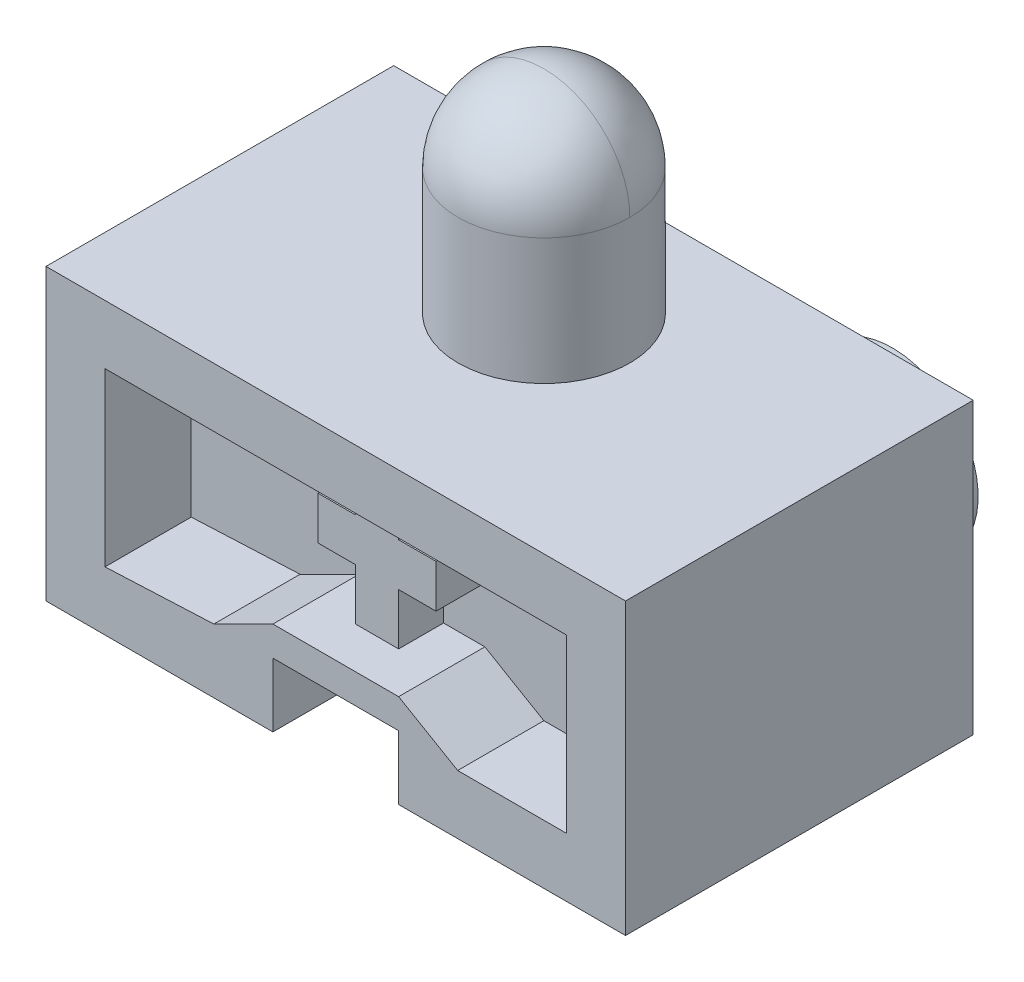
ISO-10303-21;
HEADER;
FILE_DESCRIPTION(('STEP AP214'),'2;1');
FILE_NAME('part.step','',(''),(''),'','','');
FILE_SCHEMA(('AUTOMOTIVE_DESIGN { 1 0 10303 214 1 1 1 1 }'));
ENDSEC;
DATA;
#1=APPLICATION_CONTEXT('core data for automotive mechanical design processes');
#2=APPLICATION_PROTOCOL_DEFINITION('international standard','automotive_design',2000,#1);
#3=PRODUCT_CONTEXT('',#1,'mechanical');
#4=PRODUCT('Part','Part','',(#3));
#5=PRODUCT_RELATED_PRODUCT_CATEGORY('part','',(#4));
#6=PRODUCT_DEFINITION_FORMATION('','',#4);
#7=PRODUCT_DEFINITION_CONTEXT('part definition',#1,'design');
#8=PRODUCT_DEFINITION('design','',#6,#7);
#9=PRODUCT_DEFINITION_SHAPE('','',#8);
#10=(LENGTH_UNIT() NAMED_UNIT(*) SI_UNIT(.MILLI.,.METRE.));
#11=(NAMED_UNIT(*) PLANE_ANGLE_UNIT() SI_UNIT($,.RADIAN.));
#12=(NAMED_UNIT(*) SI_UNIT($,.STERADIAN.) SOLID_ANGLE_UNIT());
#13=UNCERTAINTY_MEASURE_WITH_UNIT(LENGTH_MEASURE(1.E-05),#10,'distance_accuracy_value','');
#14=(GEOMETRIC_REPRESENTATION_CONTEXT(3) GLOBAL_UNCERTAINTY_ASSIGNED_CONTEXT((#13)) GLOBAL_UNIT_ASSIGNED_CONTEXT((#10,
#11,#12)) REPRESENTATION_CONTEXT('',''));
#15=CARTESIAN_POINT('',(0.,0.,0.));
#16=DIRECTION('',(0.,0.,1.));
#17=DIRECTION('',(1.,0.,0.));
#18=AXIS2_PLACEMENT_3D('',#15,#16,#17);
#19=CARTESIAN_POINT('',(-1.524,13.29055,6.19506));
#20=DIRECTION('',(0.,1.,0.));
#21=DIRECTION('',(0.,0.,1.));
#22=AXIS2_PLACEMENT_3D('',#19,#20,#21);
#23=PLANE('',#22);
#24=DIRECTION('',(0.,0.,1.));
#25=VECTOR('',#24,1.);
#26=CARTESIAN_POINT('',(-1.524,13.29055,6.19506));
#27=LINE('',#26,#25);
#28=CARTESIAN_POINT('',(-1.524,13.29055,6.19506));
#29=VERTEX_POINT('',#28);
#30=CARTESIAN_POINT('',(-1.524,13.29055,9.37006));
#31=VERTEX_POINT('',#30);
#32=EDGE_CURVE('E235',#29,#31,#27,.T.);
#33=ORIENTED_EDGE('',*,*,#32,.F.);
#34=DIRECTION('',(1.,0.,0.));
#35=VECTOR('',#34,1.);
#36=CARTESIAN_POINT('',(0.,13.29055,6.19506));
#37=LINE('',#36,#35);
#38=CARTESIAN_POINT('',(-4.17195,13.29055,6.19506));
#39=VERTEX_POINT('',#38);
#40=EDGE_CURVE('E376',#39,#29,#37,.T.);
#41=ORIENTED_EDGE('',*,*,#40,.F.);
#42=DIRECTION('',(0.,0.,1.));
#43=VECTOR('',#42,1.);
#44=CARTESIAN_POINT('',(-4.17195,13.29055,6.19506));
#45=LINE('',#44,#43);
#46=CARTESIAN_POINT('',(-4.17195,13.29055,9.37006));
#47=VERTEX_POINT('',#46);
#48=EDGE_CURVE('E245',#47,#39,#45,.F.);
#49=ORIENTED_EDGE('',*,*,#48,.F.);
#50=DIRECTION('',(1.,0.,0.));
#51=VECTOR('',#50,1.);
#52=CARTESIAN_POINT('',(0.,13.29055,9.37006));
#53=LINE('',#52,#51);
#54=EDGE_CURVE('E349',#31,#47,#53,.F.);
#55=ORIENTED_EDGE('',*,*,#54,.F.);
#56=EDGE_LOOP('',(#33,#41,#49,#55));
#57=FACE_BOUND('',#56,.T.);
#58=ADVANCED_FACE('F16',(#57),#23,.T.);
#59=CARTESIAN_POINT('',(-4.17195,13.29055,6.19506));
#60=DIRECTION('',(-1.,0.,0.));
#61=DIRECTION('',(0.,-1.,0.));
#62=AXIS2_PLACEMENT_3D('',#59,#60,#61);
#63=PLANE('',#62);
#64=ORIENTED_EDGE('',*,*,#48,.T.);
#65=DIRECTION('',(0.,1.,0.));
#66=VECTOR('',#65,1.);
#67=CARTESIAN_POINT('',(-4.17195,0.,6.19506));
#68=LINE('',#67,#66);
#69=CARTESIAN_POINT('',(-4.17195,10.24255,6.19506));
#70=VERTEX_POINT('',#69);
#71=EDGE_CURVE('E228',#70,#39,#68,.T.);
#72=ORIENTED_EDGE('',*,*,#71,.F.);
#73=DIRECTION('',(0.,0.,-1.));
#74=VECTOR('',#73,1.);
#75=CARTESIAN_POINT('',(-4.17195,10.24255,6.19506));
#76=LINE('',#75,#74);
#77=CARTESIAN_POINT('',(-4.17195,10.24255,9.37006));
#78=VERTEX_POINT('',#77);
#79=EDGE_CURVE('E207',#78,#70,#76,.T.);
#80=ORIENTED_EDGE('',*,*,#79,.F.);
#81=DIRECTION('',(0.,1.,0.));
#82=VECTOR('',#81,1.);
#83=CARTESIAN_POINT('',(-4.17195,0.,9.37006));
#84=LINE('',#83,#82);
#85=EDGE_CURVE('E346',#47,#78,#84,.F.);
#86=ORIENTED_EDGE('',*,*,#85,.F.);
#87=EDGE_LOOP('',(#64,#72,#80,#86));
#88=FACE_BOUND('',#87,.T.);
#89=ADVANCED_FACE('F379',(#88),#63,.T.);
#90=CARTESIAN_POINT('',(-4.17195,10.24255,6.19506));
#91=DIRECTION('',(0.,-1.,0.));
#92=DIRECTION('',(0.,0.,-1.));
#93=AXIS2_PLACEMENT_3D('',#90,#91,#92);
#94=PLANE('',#93);
#95=ORIENTED_EDGE('',*,*,#79,.T.);
#96=DIRECTION('',(1.,0.,0.));
#97=VECTOR('',#96,1.);
#98=CARTESIAN_POINT('',(0.,10.24255,6.19506));
#99=LINE('',#98,#97);
#100=CARTESIAN_POINT('',(-1.524,10.24255,6.19506));
#101=VERTEX_POINT('',#100);
#102=EDGE_CURVE('E224',#101,#70,#99,.F.);
#103=ORIENTED_EDGE('',*,*,#102,.F.);
#104=DIRECTION('',(0.,0.,1.));
#105=VECTOR('',#104,1.);
#106=CARTESIAN_POINT('',(-1.524,10.24255,6.19506));
#107=LINE('',#106,#105);
#108=CARTESIAN_POINT('',(-1.524,10.24255,9.37006));
#109=VERTEX_POINT('',#108);
#110=EDGE_CURVE('E212',#109,#101,#107,.F.);
#111=ORIENTED_EDGE('',*,*,#110,.F.);
#112=DIRECTION('',(1.,0.,0.));
#113=VECTOR('',#112,1.);
#114=CARTESIAN_POINT('',(0.,10.24255,9.37006));
#115=LINE('',#114,#113);
#116=EDGE_CURVE('E344',#78,#109,#115,.T.);
#117=ORIENTED_EDGE('',*,*,#116,.F.);
#118=EDGE_LOOP('',(#95,#103,#111,#117));
#119=FACE_BOUND('',#118,.T.);
#120=ADVANCED_FACE('F225',(#119),#94,.T.);
#121=CARTESIAN_POINT('',(1.524,10.24255,6.19506));
#122=DIRECTION('',(0.,-1.,0.));
#123=DIRECTION('',(0.,0.,-1.));
#124=AXIS2_PLACEMENT_3D('',#121,#122,#123);
#125=PLANE('',#124);
#126=DIRECTION('',(0.,0.,-1.));
#127=VECTOR('',#126,1.);
#128=CARTESIAN_POINT('',(1.524,10.24255,6.19506));
#129=LINE('',#128,#127);
#130=CARTESIAN_POINT('',(1.524,10.24255,6.19506));
#131=VERTEX_POINT('',#130);
#132=CARTESIAN_POINT('',(1.524,10.24255,9.37006));
#133=VERTEX_POINT('',#132);
#134=EDGE_CURVE('E220',#131,#133,#129,.F.);
#135=ORIENTED_EDGE('',*,*,#134,.F.);
#136=DIRECTION('',(1.,0.,0.));
#137=VECTOR('',#136,1.);
#138=CARTESIAN_POINT('',(0.,10.24255,6.19506));
#139=LINE('',#138,#137);
#140=CARTESIAN_POINT('',(4.17195,10.24255,6.19506));
#141=VERTEX_POINT('',#140);
#142=EDGE_CURVE('E364',#141,#131,#139,.F.);
#143=ORIENTED_EDGE('',*,*,#142,.F.);
#144=DIRECTION('',(0.,0.,1.));
#145=VECTOR('',#144,1.);
#146=CARTESIAN_POINT('',(4.17195,10.24255,6.19506));
#147=LINE('',#146,#145);
#148=CARTESIAN_POINT('',(4.17195,10.24255,9.37006));
#149=VERTEX_POINT('',#148);
#150=EDGE_CURVE('E242',#149,#141,#147,.F.);
#151=ORIENTED_EDGE('',*,*,#150,.F.);
#152=DIRECTION('',(1.,0.,0.));
#153=VECTOR('',#152,1.);
#154=CARTESIAN_POINT('',(0.,10.24255,9.37006));
#155=LINE('',#154,#153);
#156=EDGE_CURVE('E337',#133,#149,#155,.T.);
#157=ORIENTED_EDGE('',*,*,#156,.F.);
#158=EDGE_LOOP('',(#135,#143,#151,#157));
#159=FACE_BOUND('',#158,.T.);
#160=ADVANCED_FACE('F850',(#159),#125,.T.);
#161=CARTESIAN_POINT('',(4.17195,10.24255,6.19506));
#162=DIRECTION('',(1.,0.,0.));
#163=DIRECTION('',(0.,1.,0.));
#164=AXIS2_PLACEMENT_3D('',#161,#162,#163);
#165=PLANE('',#164);
#166=ORIENTED_EDGE('',*,*,#150,.T.);
#167=DIRECTION('',(0.,1.,0.));
#168=VECTOR('',#167,1.);
#169=CARTESIAN_POINT('',(4.17195,0.,6.19506));
#170=LINE('',#169,#168);
#171=CARTESIAN_POINT('',(4.17195,13.29055,6.19506));
#172=VERTEX_POINT('',#171);
#173=EDGE_CURVE('E367',#172,#141,#170,.F.);
#174=ORIENTED_EDGE('',*,*,#173,.F.);
#175=DIRECTION('',(0.,0.,1.));
#176=VECTOR('',#175,1.);
#177=CARTESIAN_POINT('',(4.17195,13.29055,6.19506));
#178=LINE('',#177,#176);
#179=CARTESIAN_POINT('',(4.17195,13.29055,9.37006));
#180=VERTEX_POINT('',#179);
#181=EDGE_CURVE('E221',#180,#172,#178,.F.);
#182=ORIENTED_EDGE('',*,*,#181,.F.);
#183=DIRECTION('',(0.,1.,0.));
#184=VECTOR('',#183,1.);
#185=CARTESIAN_POINT('',(4.17195,0.,9.37006));
#186=LINE('',#185,#184);
#187=EDGE_CURVE('E334',#149,#180,#186,.T.);
#188=ORIENTED_EDGE('',*,*,#187,.F.);
#189=EDGE_LOOP('',(#166,#174,#182,#188));
#190=FACE_BOUND('',#189,.T.);
#191=ADVANCED_FACE('F839',(#190),#165,.T.);
#192=CARTESIAN_POINT('',(4.17195,13.29055,6.19506));
#193=DIRECTION('',(0.,1.,0.));
#194=DIRECTION('',(0.,0.,1.));
#195=AXIS2_PLACEMENT_3D('',#192,#193,#194);
#196=PLANE('',#195);
#197=ORIENTED_EDGE('',*,*,#181,.T.);
#198=DIRECTION('',(1.,0.,0.));
#199=VECTOR('',#198,1.);
#200=CARTESIAN_POINT('',(0.,13.29055,6.19506));
#201=LINE('',#200,#199);
#202=CARTESIAN_POINT('',(1.524,13.29055,6.19506));
#203=VERTEX_POINT('',#202);
#204=EDGE_CURVE('E370',#203,#172,#201,.T.);
#205=ORIENTED_EDGE('',*,*,#204,.F.);
#206=DIRECTION('',(0.,0.,-1.));
#207=VECTOR('',#206,1.);
#208=CARTESIAN_POINT('',(1.524,13.29055,6.19506));
#209=LINE('',#208,#207);
#210=CARTESIAN_POINT('',(1.524,13.29055,9.37006));
#211=VERTEX_POINT('',#210);
#212=EDGE_CURVE('E358',#211,#203,#209,.T.);
#213=ORIENTED_EDGE('',*,*,#212,.F.);
#214=DIRECTION('',(1.,0.,0.));
#215=VECTOR('',#214,1.);
#216=CARTESIAN_POINT('',(0.,13.29055,9.37006));
#217=LINE('',#216,#215);
#218=EDGE_CURVE('E331',#180,#211,#217,.F.);
#219=ORIENTED_EDGE('',*,*,#218,.F.);
#220=EDGE_LOOP('',(#197,#205,#213,#219));
#221=FACE_BOUND('',#220,.T.);
#222=ADVANCED_FACE('F829',(#221),#196,.T.);
#223=CARTESIAN_POINT('',(-1.524,10.24255,6.19506));
#224=DIRECTION('',(-1.,0.,0.));
#225=DIRECTION('',(0.,0.,1.));
#226=AXIS2_PLACEMENT_3D('',#223,#224,#225);
#227=PLANE('',#226);
#228=ORIENTED_EDGE('',*,*,#110,.T.);
#229=DIRECTION('',(0.,1.,0.));
#230=VECTOR('',#229,1.);
#231=CARTESIAN_POINT('',(-1.524,0.,6.19506));
#232=LINE('',#231,#230);
#233=CARTESIAN_POINT('',(-1.524,6.607175,6.19506));
#234=VERTEX_POINT('',#233);
#235=EDGE_CURVE('E215',#234,#101,#232,.T.);
#236=ORIENTED_EDGE('',*,*,#235,.F.);
#237=DIRECTION('',(0.,0.,-1.));
#238=VECTOR('',#237,1.);
#239=CARTESIAN_POINT('',(-1.524,6.607175,12.29106));
#240=LINE('',#239,#238);
#241=CARTESIAN_POINT('',(-1.524,6.607175,9.37006));
#242=VERTEX_POINT('',#241);
#243=EDGE_CURVE('E316',#234,#242,#240,.F.);
#244=ORIENTED_EDGE('',*,*,#243,.T.);
#245=DIRECTION('',(0.,1.,0.));
#246=VECTOR('',#245,1.);
#247=CARTESIAN_POINT('',(-1.524,0.,9.37006));
#248=LINE('',#247,#246);
#249=EDGE_CURVE('E218',#109,#242,#248,.F.);
#250=ORIENTED_EDGE('',*,*,#249,.F.);
#251=EDGE_LOOP('',(#228,#236,#244,#250));
#252=FACE_BOUND('',#251,.T.);
#253=ADVANCED_FACE('F213',(#252),#227,.T.);
#254=CARTESIAN_POINT('',(1.524,6.607175,6.19506));
#255=DIRECTION('',(1.,0.,0.));
#256=DIRECTION('',(0.,0.,-1.));
#257=AXIS2_PLACEMENT_3D('',#254,#255,#256);
#258=PLANE('',#257);
#259=DIRECTION('',(0.,0.,-1.));
#260=VECTOR('',#259,1.);
#261=CARTESIAN_POINT('',(1.524,6.607175,12.29106));
#262=LINE('',#261,#260);
#263=CARTESIAN_POINT('',(1.524,6.607175,9.37006));
#264=VERTEX_POINT('',#263);
#265=CARTESIAN_POINT('',(1.524,6.607175,6.19506));
#266=VERTEX_POINT('',#265);
#267=EDGE_CURVE('E311',#264,#266,#262,.T.);
#268=ORIENTED_EDGE('',*,*,#267,.T.);
#269=DIRECTION('',(0.,1.,0.));
#270=VECTOR('',#269,1.);
#271=CARTESIAN_POINT('',(1.524,0.,6.19506));
#272=LINE('',#271,#270);
#273=EDGE_CURVE('E361',#131,#266,#272,.F.);
#274=ORIENTED_EDGE('',*,*,#273,.F.);
#275=ORIENTED_EDGE('',*,*,#134,.T.);
#276=DIRECTION('',(0.,1.,0.));
#277=VECTOR('',#276,1.);
#278=CARTESIAN_POINT('',(1.524,0.,9.37006));
#279=LINE('',#278,#277);
#280=EDGE_CURVE('E340',#264,#133,#279,.T.);
#281=ORIENTED_EDGE('',*,*,#280,.F.);
#282=EDGE_LOOP('',(#268,#274,#275,#281));
#283=FACE_BOUND('',#282,.T.);
#284=ADVANCED_FACE('F809',(#283),#258,.T.);
#285=CARTESIAN_POINT('',(-1.524,16.31315,6.19506));
#286=DIRECTION('',(-1.,0.,0.));
#287=DIRECTION('',(0.,0.,1.));
#288=AXIS2_PLACEMENT_3D('',#285,#286,#287);
#289=PLANE('',#288);
#290=DIRECTION('',(0.,0.,1.));
#291=VECTOR('',#290,1.);
#292=CARTESIAN_POINT('',(-1.524,16.31315,12.29106));
#293=LINE('',#292,#291);
#294=CARTESIAN_POINT('',(-1.524,16.31315,9.37006));
#295=VERTEX_POINT('',#294);
#296=CARTESIAN_POINT('',(-1.524,16.31315,6.19506));
#297=VERTEX_POINT('',#296);
#298=EDGE_CURVE('E292',#295,#297,#293,.F.);
#299=ORIENTED_EDGE('',*,*,#298,.T.);
#300=DIRECTION('',(0.,1.,0.));
#301=VECTOR('',#300,1.);
#302=CARTESIAN_POINT('',(-1.524,0.,6.19506));
#303=LINE('',#302,#301);
#304=EDGE_CURVE('E373',#29,#297,#303,.T.);
#305=ORIENTED_EDGE('',*,*,#304,.F.);
#306=ORIENTED_EDGE('',*,*,#32,.T.);
#307=DIRECTION('',(0.,1.,0.));
#308=VECTOR('',#307,1.);
#309=CARTESIAN_POINT('',(-1.524,0.,9.37006));
#310=LINE('',#309,#308);
#311=EDGE_CURVE('E352',#295,#31,#310,.F.);
#312=ORIENTED_EDGE('',*,*,#311,.F.);
#313=EDGE_LOOP('',(#299,#305,#306,#312));
#314=FACE_BOUND('',#313,.T.);
#315=ADVANCED_FACE('F385',(#314),#289,.T.);
#316=CARTESIAN_POINT('',(0.,0.,6.19506));
#317=DIRECTION('',(0.,0.,1.));
#318=DIRECTION('',(1.,0.,0.));
#319=AXIS2_PLACEMENT_3D('',#316,#317,#318);
#320=PLANE('',#319);
#321=ORIENTED_EDGE('',*,*,#40,.T.);
#322=ORIENTED_EDGE('',*,*,#304,.T.);
#323=DIRECTION('',(1.,0.,0.));
#324=VECTOR('',#323,1.);
#325=CARTESIAN_POINT('',(16.31315,16.31315,6.19506));
#326=LINE('',#325,#324);
#327=CARTESIAN_POINT('',(-16.31315,16.31315,6.19506));
#328=VERTEX_POINT('',#327);
#329=EDGE_CURVE('E290',#297,#328,#326,.F.);
#330=ORIENTED_EDGE('',*,*,#329,.T.);
#331=DIRECTION('',(0.,1.,0.));
#332=VECTOR('',#331,1.);
#333=CARTESIAN_POINT('',(-16.31315,16.31315,6.19506));
#334=LINE('',#333,#332);
#335=CARTESIAN_POINT('',(-16.31315,4.17195,6.19506));
#336=VERTEX_POINT('',#335);
#337=EDGE_CURVE('E296',#328,#336,#334,.F.);
#338=ORIENTED_EDGE('',*,*,#337,.T.);
#339=DIRECTION('',(0.998971936315906,0.045332884898824,0.));
#340=VECTOR('',#339,1.);
#341=CARTESIAN_POINT('',(-16.31315,4.17195,6.19506));
#342=LINE('',#341,#340);
#343=CARTESIAN_POINT('',(-8.61695,4.5212,6.19506));
#344=VERTEX_POINT('',#343);
#345=EDGE_CURVE('E300',#336,#344,#342,.T.);
#346=ORIENTED_EDGE('',*,*,#345,.T.);
#347=DIRECTION('',(0.894427190999916,0.447213595499958,0.));
#348=VECTOR('',#347,1.);
#349=CARTESIAN_POINT('',(-8.61695,4.5212,6.19506));
#350=LINE('',#349,#348);
#351=CARTESIAN_POINT('',(-4.445,6.607175,6.19506));
#352=VERTEX_POINT('',#351);
#353=EDGE_CURVE('E304',#344,#352,#350,.T.);
#354=ORIENTED_EDGE('',*,*,#353,.T.);
#355=DIRECTION('',(1.,0.,0.));
#356=VECTOR('',#355,1.);
#357=CARTESIAN_POINT('',(-4.445,6.607175,6.19506));
#358=LINE('',#357,#356);
#359=EDGE_CURVE('E233',#352,#234,#358,.T.);
#360=ORIENTED_EDGE('',*,*,#359,.T.);
#361=ORIENTED_EDGE('',*,*,#235,.T.);
#362=ORIENTED_EDGE('',*,*,#102,.T.);
#363=ORIENTED_EDGE('',*,*,#71,.T.);
#364=EDGE_LOOP('',(#321,#322,#330,#338,#346,#354,#360,#361,#362,#363));
#365=FACE_BOUND('',#364,.T.);
#366=ADVANCED_FACE('F231',(#365),#320,.T.);
#367=CARTESIAN_POINT('',(0.,0.,6.19506));
#368=DIRECTION('',(0.,0.,1.));
#369=DIRECTION('',(1.,0.,0.));
#370=AXIS2_PLACEMENT_3D('',#367,#368,#369);
#371=PLANE('',#370);
#372=ORIENTED_EDGE('',*,*,#142,.T.);
#373=ORIENTED_EDGE('',*,*,#273,.T.);
#374=DIRECTION('',(1.,0.,0.));
#375=VECTOR('',#374,1.);
#376=CARTESIAN_POINT('',(-4.445,6.607175,6.19506));
#377=LINE('',#376,#375);
#378=CARTESIAN_POINT('',(4.445,6.607175,6.19506));
#379=VERTEX_POINT('',#378);
#380=EDGE_CURVE('E309',#266,#379,#377,.T.);
#381=ORIENTED_EDGE('',*,*,#380,.T.);
#382=DIRECTION('',(0.863635836054113,-0.504116199584098,0.));
#383=VECTOR('',#382,1.);
#384=CARTESIAN_POINT('',(4.445,6.607175,6.19506));
#385=LINE('',#384,#383);
#386=CARTESIAN_POINT('',(8.61695,4.17195,6.19506));
#387=VERTEX_POINT('',#386);
#388=EDGE_CURVE('E320',#379,#387,#385,.T.);
#389=ORIENTED_EDGE('',*,*,#388,.T.);
#390=DIRECTION('',(1.,0.,0.));
#391=VECTOR('',#390,1.);
#392=CARTESIAN_POINT('',(8.61695,4.17195,6.19506));
#393=LINE('',#392,#391);
#394=CARTESIAN_POINT('',(16.31315,4.17195,6.19506));
#395=VERTEX_POINT('',#394);
#396=EDGE_CURVE('E324',#387,#395,#393,.T.);
#397=ORIENTED_EDGE('',*,*,#396,.T.);
#398=DIRECTION('',(0.,1.,0.));
#399=VECTOR('',#398,1.);
#400=CARTESIAN_POINT('',(16.31315,4.17195,6.19506));
#401=LINE('',#400,#399);
#402=CARTESIAN_POINT('',(16.31315,16.31315,6.19506));
#403=VERTEX_POINT('',#402);
#404=EDGE_CURVE('E326',#395,#403,#401,.T.);
#405=ORIENTED_EDGE('',*,*,#404,.T.);
#406=DIRECTION('',(1.,0.,0.));
#407=VECTOR('',#406,1.);
#408=CARTESIAN_POINT('',(16.31315,16.31315,6.19506));
#409=LINE('',#408,#407);
#410=CARTESIAN_POINT('',(1.524,16.31315,6.19506));
#411=VERTEX_POINT('',#410);
#412=EDGE_CURVE('E283',#403,#411,#409,.F.);
#413=ORIENTED_EDGE('',*,*,#412,.T.);
#414=DIRECTION('',(0.,1.,0.));
#415=VECTOR('',#414,1.);
#416=CARTESIAN_POINT('',(1.524,13.29055,6.19506));
#417=LINE('',#416,#415);
#418=EDGE_CURVE('E355',#203,#411,#417,.T.);
#419=ORIENTED_EDGE('',*,*,#418,.F.);
#420=ORIENTED_EDGE('',*,*,#204,.T.);
#421=ORIENTED_EDGE('',*,*,#173,.T.);
#422=EDGE_LOOP('',(#372,#373,#381,#389,#397,#405,#413,#419,#420,#421));
#423=FACE_BOUND('',#422,.T.);
#424=ADVANCED_FACE('F432',(#423),#371,.T.);
#425=CARTESIAN_POINT('',(1.524,13.29055,6.19506));
#426=DIRECTION('',(1.,0.,0.));
#427=DIRECTION('',(0.,0.,-1.));
#428=AXIS2_PLACEMENT_3D('',#425,#426,#427);
#429=PLANE('',#428);
#430=ORIENTED_EDGE('',*,*,#212,.T.);
#431=ORIENTED_EDGE('',*,*,#418,.T.);
#432=DIRECTION('',(0.,0.,1.));
#433=VECTOR('',#432,1.);
#434=CARTESIAN_POINT('',(1.524,16.31315,12.29106));
#435=LINE('',#434,#433);
#436=CARTESIAN_POINT('',(1.524,16.31315,9.37006));
#437=VERTEX_POINT('',#436);
#438=EDGE_CURVE('E281',#411,#437,#435,.T.);
#439=ORIENTED_EDGE('',*,*,#438,.T.);
#440=DIRECTION('',(0.,1.,0.));
#441=VECTOR('',#440,1.);
#442=CARTESIAN_POINT('',(1.524,0.,9.37006));
#443=LINE('',#442,#441);
#444=EDGE_CURVE('E328',#211,#437,#443,.T.);
#445=ORIENTED_EDGE('',*,*,#444,.F.);
#446=EDGE_LOOP('',(#430,#431,#439,#445));
#447=FACE_BOUND('',#446,.T.);
#448=ADVANCED_FACE('F429',(#447),#429,.T.);
#449=CARTESIAN_POINT('',(0.,0.,9.37006));
#450=DIRECTION('',(0.,0.,1.));
#451=DIRECTION('',(1.,0.,0.));
#452=AXIS2_PLACEMENT_3D('',#449,#450,#451);
#453=PLANE('',#452);
#454=ORIENTED_EDGE('',*,*,#444,.T.);
#455=DIRECTION('',(1.,0.,0.));
#456=VECTOR('',#455,1.);
#457=CARTESIAN_POINT('',(16.31315,16.31315,9.37006));
#458=LINE('',#457,#456);
#459=EDGE_CURVE('E278',#437,#295,#458,.F.);
#460=ORIENTED_EDGE('',*,*,#459,.T.);
#461=ORIENTED_EDGE('',*,*,#311,.T.);
#462=ORIENTED_EDGE('',*,*,#54,.T.);
#463=ORIENTED_EDGE('',*,*,#85,.T.);
#464=ORIENTED_EDGE('',*,*,#116,.T.);
#465=ORIENTED_EDGE('',*,*,#249,.T.);
#466=DIRECTION('',(1.,0.,0.));
#467=VECTOR('',#466,1.);
#468=CARTESIAN_POINT('',(-4.445,6.607175,9.37006));
#469=LINE('',#468,#467);
#470=EDGE_CURVE('E313',#242,#264,#469,.T.);
#471=ORIENTED_EDGE('',*,*,#470,.T.);
#472=ORIENTED_EDGE('',*,*,#280,.T.);
#473=ORIENTED_EDGE('',*,*,#156,.T.);
#474=ORIENTED_EDGE('',*,*,#187,.T.);
#475=ORIENTED_EDGE('',*,*,#218,.T.);
#476=EDGE_LOOP('',(#454,#460,#461,#462,#463,#464,#465,#471,#472,#473,#474,#475));
#477=FACE_BOUND('',#476,.T.);
#478=ADVANCED_FACE('F425',(#477),#453,.T.);
#479=CARTESIAN_POINT('',(0.,0.,-16.81226));
#480=DIRECTION('',(0.,0.,-1.));
#481=DIRECTION('',(-1.,0.,0.));
#482=AXIS2_PLACEMENT_3D('',#479,#480,#481);
#483=PLANE('',#482);
#484=CARTESIAN_POINT('',(10.24255,10.24255,-16.81226));
#485=DIRECTION('',(0.,0.,-1.));
#486=DIRECTION('',(-1.,0.,0.));
#487=AXIS2_PLACEMENT_3D('',#484,#485,#486);
#488=CIRCLE('',#487,6.0706);
#489=CARTESIAN_POINT('',(4.17195,10.24255,-16.81226));
#490=VERTEX_POINT('',#489);
#491=EDGE_CURVE('E19',#490,#490,#488,.F.);
#492=ORIENTED_EDGE('',*,*,#491,.F.);
#493=EDGE_LOOP('',(#492));
#494=FACE_BOUND('',#493,.T.);
#495=ADVANCED_FACE('F752',(#494),#483,.T.);
#496=CARTESIAN_POINT('',(0.,0.,-16.81226));
#497=DIRECTION('',(0.,0.,-1.));
#498=DIRECTION('',(-1.,0.,0.));
#499=AXIS2_PLACEMENT_3D('',#496,#497,#498);
#500=PLANE('',#499);
#501=CARTESIAN_POINT('',(-10.24255,10.24255,-16.81226));
#502=DIRECTION('',(0.,0.,-1.));
#503=DIRECTION('',(-1.,0.,0.));
#504=AXIS2_PLACEMENT_3D('',#501,#502,#503);
#505=CIRCLE('',#504,6.0706);
#506=CARTESIAN_POINT('',(-16.31315,10.24255,-16.81226));
#507=VERTEX_POINT('',#506);
#508=EDGE_CURVE('E254',#507,#507,#505,.F.);
#509=ORIENTED_EDGE('',*,*,#508,.F.);
#510=EDGE_LOOP('',(#509));
#511=FACE_BOUND('',#510,.T.);
#512=ADVANCED_FACE('F742',(#511),#500,.T.);
#513=CARTESIAN_POINT('',(16.31315,4.17195,12.29106));
#514=DIRECTION('',(1.,0.,0.));
#515=DIRECTION('',(0.,0.,-1.));
#516=AXIS2_PLACEMENT_3D('',#513,#514,#515);
#517=PLANE('',#516);
#518=ORIENTED_EDGE('',*,*,#404,.F.);
#519=DIRECTION('',(0.,0.,-1.));
#520=VECTOR('',#519,1.);
#521=CARTESIAN_POINT('',(16.31315,4.17195,12.29106));
#522=LINE('',#521,#520);
#523=CARTESIAN_POINT('',(16.31315,4.17195,12.29106));
#524=VERTEX_POINT('',#523);
#525=EDGE_CURVE('E322',#395,#524,#522,.F.);
#526=ORIENTED_EDGE('',*,*,#525,.T.);
#527=DIRECTION('',(0.,1.,0.));
#528=VECTOR('',#527,1.);
#529=CARTESIAN_POINT('',(16.31315,0.,12.29106));
#530=LINE('',#529,#528);
#531=CARTESIAN_POINT('',(16.31315,16.31315,12.29106));
#532=VERTEX_POINT('',#531);
#533=EDGE_CURVE('E439',#532,#524,#530,.F.);
#534=ORIENTED_EDGE('',*,*,#533,.F.);
#535=DIRECTION('',(0.,0.,1.));
#536=VECTOR('',#535,1.);
#537=CARTESIAN_POINT('',(16.31315,16.31315,12.29106));
#538=LINE('',#537,#536);
#539=EDGE_CURVE('E285',#532,#403,#538,.F.);
#540=ORIENTED_EDGE('',*,*,#539,.T.);
#541=EDGE_LOOP('',(#518,#526,#534,#540));
#542=FACE_BOUND('',#541,.T.);
#543=ADVANCED_FACE('F437',(#542),#517,.F.);
#544=CARTESIAN_POINT('',(8.61695,4.17195,12.29106));
#545=DIRECTION('',(0.,-1.,0.));
#546=DIRECTION('',(0.,0.,-1.));
#547=AXIS2_PLACEMENT_3D('',#544,#545,#546);
#548=PLANE('',#547);
#549=ORIENTED_EDGE('',*,*,#396,.F.);
#550=DIRECTION('',(0.,0.,1.));
#551=VECTOR('',#550,1.);
#552=CARTESIAN_POINT('',(8.61695,4.17195,12.29106));
#553=LINE('',#552,#551);
#554=CARTESIAN_POINT('',(8.61695,4.17195,12.29106));
#555=VERTEX_POINT('',#554);
#556=EDGE_CURVE('E318',#387,#555,#553,.T.);
#557=ORIENTED_EDGE('',*,*,#556,.T.);
#558=DIRECTION('',(1.,0.,0.));
#559=VECTOR('',#558,1.);
#560=CARTESIAN_POINT('',(-20.4851,4.17195,12.29106));
#561=LINE('',#560,#559);
#562=EDGE_CURVE('E459',#524,#555,#561,.F.);
#563=ORIENTED_EDGE('',*,*,#562,.F.);
#564=ORIENTED_EDGE('',*,*,#525,.F.);
#565=EDGE_LOOP('',(#549,#557,#563,#564));
#566=FACE_BOUND('',#565,.T.);
#567=ADVANCED_FACE('F721',(#566),#548,.F.);
#568=CARTESIAN_POINT('',(4.445,6.607175,12.29106));
#569=DIRECTION('',(-0.504116199584098,-0.863635836054113,0.));
#570=DIRECTION('',(0.863635836054113,-0.504116199584098,0.));
#571=AXIS2_PLACEMENT_3D('',#568,#569,#570);
#572=PLANE('',#571);
#573=ORIENTED_EDGE('',*,*,#388,.F.);
#574=DIRECTION('',(0.,0.,-1.));
#575=VECTOR('',#574,1.);
#576=CARTESIAN_POINT('',(4.445,6.607175,12.29106));
#577=LINE('',#576,#575);
#578=CARTESIAN_POINT('',(4.445,6.607175,12.29106));
#579=VERTEX_POINT('',#578);
#580=EDGE_CURVE('E307',#379,#579,#577,.F.);
#581=ORIENTED_EDGE('',*,*,#580,.T.);
#582=DIRECTION('',(-0.863635836054113,0.504116199584098,0.));
#583=VECTOR('',#582,1.);
#584=CARTESIAN_POINT('',(8.61695,4.17195,12.29106));
#585=LINE('',#584,#583);
#586=EDGE_CURVE('E456',#555,#579,#585,.T.);
#587=ORIENTED_EDGE('',*,*,#586,.F.);
#588=ORIENTED_EDGE('',*,*,#556,.F.);
#589=EDGE_LOOP('',(#573,#581,#587,#588));
#590=FACE_BOUND('',#589,.T.);
#591=ADVANCED_FACE('F711',(#590),#572,.F.);
#592=CARTESIAN_POINT('',(-4.445,6.607175,12.29106));
#593=DIRECTION('',(0.,-1.,0.));
#594=DIRECTION('',(0.,0.,-1.));
#595=AXIS2_PLACEMENT_3D('',#592,#593,#594);
#596=PLANE('',#595);
#597=DIRECTION('',(0.,0.,1.));
#598=VECTOR('',#597,1.);
#599=CARTESIAN_POINT('',(-4.445,6.607175,12.29106));
#600=LINE('',#599,#598);
#601=CARTESIAN_POINT('',(-4.445,6.607175,12.29106));
#602=VERTEX_POINT('',#601);
#603=EDGE_CURVE('E302',#352,#602,#600,.T.);
#604=ORIENTED_EDGE('',*,*,#603,.T.);
#605=DIRECTION('',(1.,0.,0.));
#606=VECTOR('',#605,1.);
#607=CARTESIAN_POINT('',(-20.4851,6.607175,12.29106));
#608=LINE('',#607,#606);
#609=EDGE_CURVE('E454',#579,#602,#608,.F.);
#610=ORIENTED_EDGE('',*,*,#609,.F.);
#611=ORIENTED_EDGE('',*,*,#580,.F.);
#612=ORIENTED_EDGE('',*,*,#380,.F.);
#613=ORIENTED_EDGE('',*,*,#267,.F.);
#614=ORIENTED_EDGE('',*,*,#470,.F.);
#615=ORIENTED_EDGE('',*,*,#243,.F.);
#616=ORIENTED_EDGE('',*,*,#359,.F.);
#617=EDGE_LOOP('',(#604,#610,#611,#612,#613,#614,#615,#616));
#618=FACE_BOUND('',#617,.T.);
#619=ADVANCED_FACE('F420',(#618),#596,.F.);
#620=CARTESIAN_POINT('',(-8.61695,4.5212,12.29106));
#621=DIRECTION('',(0.447213595499958,-0.894427190999916,0.));
#622=DIRECTION('',(0.894427190999916,0.447213595499958,0.));
#623=AXIS2_PLACEMENT_3D('',#620,#621,#622);
#624=PLANE('',#623);
#625=ORIENTED_EDGE('',*,*,#353,.F.);
#626=DIRECTION('',(0.,0.,1.));
#627=VECTOR('',#626,1.);
#628=CARTESIAN_POINT('',(-8.61695,4.5212,12.29106));
#629=LINE('',#628,#627);
#630=CARTESIAN_POINT('',(-8.61695,4.5212,12.29106));
#631=VERTEX_POINT('',#630);
#632=EDGE_CURVE('E298',#344,#631,#629,.T.);
#633=ORIENTED_EDGE('',*,*,#632,.T.);
#634=DIRECTION('',(-0.894427190999916,-0.447213595499958,0.));
#635=VECTOR('',#634,1.);
#636=CARTESIAN_POINT('',(-4.445,6.607175,12.29106));
#637=LINE('',#636,#635);
#638=EDGE_CURVE('E417',#602,#631,#637,.T.);
#639=ORIENTED_EDGE('',*,*,#638,.F.);
#640=ORIENTED_EDGE('',*,*,#603,.F.);
#641=EDGE_LOOP('',(#625,#633,#639,#640));
#642=FACE_BOUND('',#641,.T.);
#643=ADVANCED_FACE('F415',(#642),#624,.F.);
#644=CARTESIAN_POINT('',(-16.31315,4.17195,12.29106));
#645=DIRECTION('',(0.045332884898824,-0.998971936315906,0.));
#646=DIRECTION('',(0.998971936315906,0.045332884898824,0.));
#647=AXIS2_PLACEMENT_3D('',#644,#645,#646);
#648=PLANE('',#647);
#649=ORIENTED_EDGE('',*,*,#345,.F.);
#650=DIRECTION('',(0.,0.,1.));
#651=VECTOR('',#650,1.);
#652=CARTESIAN_POINT('',(-16.31315,4.17195,12.29106));
#653=LINE('',#652,#651);
#654=CARTESIAN_POINT('',(-16.31315,4.17195,12.29106));
#655=VERTEX_POINT('',#654);
#656=EDGE_CURVE('E294',#336,#655,#653,.T.);
#657=ORIENTED_EDGE('',*,*,#656,.T.);
#658=DIRECTION('',(-0.998971936315906,-0.0453328848988241,0.));
#659=VECTOR('',#658,1.);
#660=CARTESIAN_POINT('',(-8.61695,4.5212,12.29106));
#661=LINE('',#660,#659);
#662=EDGE_CURVE('E411',#631,#655,#661,.T.);
#663=ORIENTED_EDGE('',*,*,#662,.F.);
#664=ORIENTED_EDGE('',*,*,#632,.F.);
#665=EDGE_LOOP('',(#649,#657,#663,#664));
#666=FACE_BOUND('',#665,.T.);
#667=ADVANCED_FACE('F409',(#666),#648,.F.);
#668=CARTESIAN_POINT('',(-16.31315,16.31315,12.29106));
#669=DIRECTION('',(-1.,0.,0.));
#670=DIRECTION('',(0.,0.,1.));
#671=AXIS2_PLACEMENT_3D('',#668,#669,#670);
#672=PLANE('',#671);
#673=ORIENTED_EDGE('',*,*,#337,.F.);
#674=DIRECTION('',(0.,0.,1.));
#675=VECTOR('',#674,1.);
#676=CARTESIAN_POINT('',(-16.31315,16.31315,12.29106));
#677=LINE('',#676,#675);
#678=CARTESIAN_POINT('',(-16.31315,16.31315,12.29106));
#679=VERTEX_POINT('',#678);
#680=EDGE_CURVE('E288',#328,#679,#677,.T.);
#681=ORIENTED_EDGE('',*,*,#680,.T.);
#682=DIRECTION('',(0.,1.,0.));
#683=VECTOR('',#682,1.);
#684=CARTESIAN_POINT('',(-16.31315,0.,12.29106));
#685=LINE('',#684,#683);
#686=EDGE_CURVE('E403',#655,#679,#685,.T.);
#687=ORIENTED_EDGE('',*,*,#686,.F.);
#688=ORIENTED_EDGE('',*,*,#656,.F.);
#689=EDGE_LOOP('',(#673,#681,#687,#688));
#690=FACE_BOUND('',#689,.T.);
#691=ADVANCED_FACE('F401',(#690),#672,.F.);
#692=CARTESIAN_POINT('',(16.31315,16.31315,12.29106));
#693=DIRECTION('',(0.,1.,0.));
#694=DIRECTION('',(0.,0.,1.));
#695=AXIS2_PLACEMENT_3D('',#692,#693,#694);
#696=PLANE('',#695);
#697=ORIENTED_EDGE('',*,*,#438,.F.);
#698=ORIENTED_EDGE('',*,*,#412,.F.);
#699=ORIENTED_EDGE('',*,*,#539,.F.);
#700=DIRECTION('',(1.,0.,0.));
#701=VECTOR('',#700,1.);
#702=CARTESIAN_POINT('',(-20.4851,16.31315,12.29106));
#703=LINE('',#702,#701);
#704=EDGE_CURVE('E397',#679,#532,#703,.T.);
#705=ORIENTED_EDGE('',*,*,#704,.F.);
#706=ORIENTED_EDGE('',*,*,#680,.F.);
#707=ORIENTED_EDGE('',*,*,#329,.F.);
#708=ORIENTED_EDGE('',*,*,#298,.F.);
#709=ORIENTED_EDGE('',*,*,#459,.F.);
#710=EDGE_LOOP('',(#697,#698,#699,#705,#706,#707,#708,#709));
#711=FACE_BOUND('',#710,.T.);
#712=ADVANCED_FACE('F392',(#711),#696,.F.);
#713=CARTESIAN_POINT('',(-4.445,0.,12.29106));
#714=DIRECTION('',(-1.,0.,0.));
#715=DIRECTION('',(0.,0.,1.));
#716=AXIS2_PLACEMENT_3D('',#713,#714,#715);
#717=PLANE('',#716);
#718=DIRECTION('',(0.,0.,-1.));
#719=VECTOR('',#718,1.);
#720=CARTESIAN_POINT('',(-4.445,4.5212,0.));
#721=LINE('',#720,#719);
#722=CARTESIAN_POINT('',(-4.445,4.5212,12.29106));
#723=VERTEX_POINT('',#722);
#724=CARTESIAN_POINT('',(-4.445,4.5212,-12.29106));
#725=VERTEX_POINT('',#724);
#726=EDGE_CURVE('E266',#723,#725,#721,.T.);
#727=ORIENTED_EDGE('',*,*,#726,.F.);
#728=DIRECTION('',(0.,1.,0.));
#729=VECTOR('',#728,1.);
#730=CARTESIAN_POINT('',(-4.445,0.,12.29106));
#731=LINE('',#730,#729);
#732=CARTESIAN_POINT('',(-4.445,0.,12.29106));
#733=VERTEX_POINT('',#732);
#734=EDGE_CURVE('E464',#733,#723,#731,.T.);
#735=ORIENTED_EDGE('',*,*,#734,.F.);
#736=DIRECTION('',(0.,0.,1.));
#737=VECTOR('',#736,1.);
#738=CARTESIAN_POINT('',(-4.445,0.,0.));
#739=LINE('',#738,#737);
#740=CARTESIAN_POINT('',(-4.445,0.,-12.29106));
#741=VERTEX_POINT('',#740);
#742=EDGE_CURVE('E256',#733,#741,#739,.F.);
#743=ORIENTED_EDGE('',*,*,#742,.T.);
#744=DIRECTION('',(0.,1.,0.));
#745=VECTOR('',#744,1.);
#746=CARTESIAN_POINT('',(-4.445,0.,-12.29106));
#747=LINE('',#746,#745);
#748=EDGE_CURVE('E538',#725,#741,#747,.F.);
#749=ORIENTED_EDGE('',*,*,#748,.F.);
#750=EDGE_LOOP('',(#727,#735,#743,#749));
#751=FACE_BOUND('',#750,.T.);
#752=ADVANCED_FACE('F565',(#751),#717,.F.);
#753=CARTESIAN_POINT('',(0.,0.,0.));
#754=DIRECTION('',(0.,1.,0.));
#755=DIRECTION('',(0.,0.,1.));
#756=AXIS2_PLACEMENT_3D('',#753,#754,#755);
#757=PLANE('',#756);
#758=DIRECTION('',(0.,0.,-1.));
#759=VECTOR('',#758,1.);
#760=CARTESIAN_POINT('',(20.4851,0.,12.29106));
#761=LINE('',#760,#759);
#762=CARTESIAN_POINT('',(20.4851,0.,12.29106));
#763=VERTEX_POINT('',#762);
#764=CARTESIAN_POINT('',(20.4851,0.,-12.29106));
#765=VERTEX_POINT('',#764);
#766=EDGE_CURVE('E447',#763,#765,#761,.T.);
#767=ORIENTED_EDGE('',*,*,#766,.F.);
#768=DIRECTION('',(1.,0.,0.));
#769=VECTOR('',#768,1.);
#770=CARTESIAN_POINT('',(-20.4851,0.,12.29106));
#771=LINE('',#770,#769);
#772=CARTESIAN_POINT('',(4.445,0.,12.29106));
#773=VERTEX_POINT('',#772);
#774=EDGE_CURVE('E470',#773,#763,#771,.T.);
#775=ORIENTED_EDGE('',*,*,#774,.F.);
#776=DIRECTION('',(0.,0.,-1.));
#777=VECTOR('',#776,1.);
#778=CARTESIAN_POINT('',(4.445,0.,-12.29106));
#779=LINE('',#778,#777);
#780=CARTESIAN_POINT('',(4.445,0.,-12.29106));
#781=VERTEX_POINT('',#780);
#782=EDGE_CURVE('E273',#773,#781,#779,.T.);
#783=ORIENTED_EDGE('',*,*,#782,.T.);
#784=DIRECTION('',(-1.,0.,0.));
#785=VECTOR('',#784,1.);
#786=CARTESIAN_POINT('',(20.4851,0.,-12.29106));
#787=LINE('',#786,#785);
#788=EDGE_CURVE('E530',#765,#781,#787,.T.);
#789=ORIENTED_EDGE('',*,*,#788,.F.);
#790=EDGE_LOOP('',(#767,#775,#783,#789));
#791=FACE_BOUND('',#790,.T.);
#792=ADVANCED_FACE('F547',(#791),#757,.F.);
#793=CARTESIAN_POINT('',(4.445,0.,-12.29106));
#794=DIRECTION('',(1.,0.,0.));
#795=DIRECTION('',(0.,0.,-1.));
#796=AXIS2_PLACEMENT_3D('',#793,#794,#795);
#797=PLANE('',#796);
#798=DIRECTION('',(0.,0.,-1.));
#799=VECTOR('',#798,1.);
#800=CARTESIAN_POINT('',(4.445,4.5212,0.));
#801=LINE('',#800,#799);
#802=CARTESIAN_POINT('',(4.445,4.5212,-12.29106));
#803=VERTEX_POINT('',#802);
#804=CARTESIAN_POINT('',(4.445,4.5212,12.29106));
#805=VERTEX_POINT('',#804);
#806=EDGE_CURVE('E262',#803,#805,#801,.F.);
#807=ORIENTED_EDGE('',*,*,#806,.F.);
#808=DIRECTION('',(0.,1.,0.));
#809=VECTOR('',#808,1.);
#810=CARTESIAN_POINT('',(4.445,0.,-12.29106));
#811=LINE('',#810,#809);
#812=EDGE_CURVE('E527',#781,#803,#811,.T.);
#813=ORIENTED_EDGE('',*,*,#812,.F.);
#814=ORIENTED_EDGE('',*,*,#782,.F.);
#815=DIRECTION('',(0.,1.,0.));
#816=VECTOR('',#815,1.);
#817=CARTESIAN_POINT('',(4.445,0.,12.29106));
#818=LINE('',#817,#816);
#819=EDGE_CURVE('E472',#805,#773,#818,.F.);
#820=ORIENTED_EDGE('',*,*,#819,.F.);
#821=EDGE_LOOP('',(#807,#813,#814,#820));
#822=FACE_BOUND('',#821,.T.);
#823=ADVANCED_FACE('F561',(#822),#797,.F.);
#824=CARTESIAN_POINT('',(0.,4.5212,0.));
#825=DIRECTION('',(0.,-1.,0.));
#826=DIRECTION('',(0.,0.,-1.));
#827=AXIS2_PLACEMENT_3D('',#824,#825,#826);
#828=PLANE('',#827);
#829=ORIENTED_EDGE('',*,*,#806,.T.);
#830=DIRECTION('',(1.,0.,0.));
#831=VECTOR('',#830,1.);
#832=CARTESIAN_POINT('',(-20.4851,4.5212,12.29106));
#833=LINE('',#832,#831);
#834=EDGE_CURVE('E462',#723,#805,#833,.T.);
#835=ORIENTED_EDGE('',*,*,#834,.F.);
#836=ORIENTED_EDGE('',*,*,#726,.T.);
#837=DIRECTION('',(-1.,0.,0.));
#838=VECTOR('',#837,1.);
#839=CARTESIAN_POINT('',(20.4851,4.5212,-12.29106));
#840=LINE('',#839,#838);
#841=EDGE_CURVE('E253',#803,#725,#840,.T.);
#842=ORIENTED_EDGE('',*,*,#841,.F.);
#843=EDGE_LOOP('',(#829,#835,#836,#842));
#844=FACE_BOUND('',#843,.T.);
#845=ADVANCED_FACE('F562',(#844),#828,.T.);
#846=CARTESIAN_POINT('',(10.24255,10.24255,-12.29106));
#847=DIRECTION('',(0.,0.,-1.));
#848=DIRECTION('',(-1.,0.,0.));
#849=AXIS2_PLACEMENT_3D('',#846,#847,#848);
#850=CYLINDRICAL_SURFACE('',#849,6.0706);
#851=ORIENTED_EDGE('',*,*,#491,.T.);
#852=EDGE_LOOP('',(#851));
#853=FACE_BOUND('',#852,.T.);
#854=CARTESIAN_POINT('',(10.24255,10.24255,-12.29106));
#855=DIRECTION('',(0.,0.,-1.));
#856=DIRECTION('',(-1.,0.,0.));
#857=AXIS2_PLACEMENT_3D('',#854,#855,#856);
#858=CIRCLE('',#857,6.0706);
#859=CARTESIAN_POINT('',(4.17195,10.24255,-12.29106));
#860=VERTEX_POINT('',#859);
#861=EDGE_CURVE('E251',#860,#860,#858,.F.);
#862=ORIENTED_EDGE('',*,*,#861,.F.);
#863=EDGE_LOOP('',(#862));
#864=FACE_BOUND('',#863,.T.);
#865=ADVANCED_FACE('F574',(#853,#864),#850,.T.);
#866=CARTESIAN_POINT('',(-10.24255,10.24255,-12.29106));
#867=DIRECTION('',(0.,0.,-1.));
#868=DIRECTION('',(-1.,0.,0.));
#869=AXIS2_PLACEMENT_3D('',#866,#867,#868);
#870=CYLINDRICAL_SURFACE('',#869,6.0706);
#871=ORIENTED_EDGE('',*,*,#508,.T.);
#872=EDGE_LOOP('',(#871));
#873=FACE_BOUND('',#872,.T.);
#874=CARTESIAN_POINT('',(-10.24255,10.24255,-12.29106));
#875=DIRECTION('',(0.,0.,-1.));
#876=DIRECTION('',(-1.,0.,0.));
#877=AXIS2_PLACEMENT_3D('',#874,#875,#876);
#878=CIRCLE('',#877,6.0706);
#879=CARTESIAN_POINT('',(-16.31315,10.24255,-12.29106));
#880=VERTEX_POINT('',#879);
#881=EDGE_CURVE('E247',#880,#880,#878,.F.);
#882=ORIENTED_EDGE('',*,*,#881,.F.);
#883=EDGE_LOOP('',(#882));
#884=FACE_BOUND('',#883,.T.);
#885=ADVANCED_FACE('F569',(#873,#884),#870,.T.);
#886=CARTESIAN_POINT('',(0.,0.,0.));
#887=DIRECTION('',(0.,1.,0.));
#888=DIRECTION('',(0.,0.,1.));
#889=AXIS2_PLACEMENT_3D('',#886,#887,#888);
#890=PLANE('',#889);
#891=DIRECTION('',(0.,0.,1.));
#892=VECTOR('',#891,1.);
#893=CARTESIAN_POINT('',(-20.4851,0.,-12.29106));
#894=LINE('',#893,#892);
#895=CARTESIAN_POINT('',(-20.4851,0.,-12.29106));
#896=VERTEX_POINT('',#895);
#897=CARTESIAN_POINT('',(-20.4851,0.,12.29106));
#898=VERTEX_POINT('',#897);
#899=EDGE_CURVE('E515',#896,#898,#894,.T.);
#900=ORIENTED_EDGE('',*,*,#899,.F.);
#901=DIRECTION('',(-1.,0.,0.));
#902=VECTOR('',#901,1.);
#903=CARTESIAN_POINT('',(20.4851,0.,-12.29106));
#904=LINE('',#903,#902);
#905=EDGE_CURVE('E536',#741,#896,#904,.T.);
#906=ORIENTED_EDGE('',*,*,#905,.F.);
#907=ORIENTED_EDGE('',*,*,#742,.F.);
#908=DIRECTION('',(1.,0.,0.));
#909=VECTOR('',#908,1.);
#910=CARTESIAN_POINT('',(-20.4851,0.,12.29106));
#911=LINE('',#910,#909);
#912=EDGE_CURVE('E467',#898,#733,#911,.T.);
#913=ORIENTED_EDGE('',*,*,#912,.F.);
#914=EDGE_LOOP('',(#900,#906,#907,#913));
#915=FACE_BOUND('',#914,.T.);
#916=ADVANCED_FACE('F490',(#915),#890,.F.);
#917=CARTESIAN_POINT('',(0.,29.4005,-2.42824));
#918=DIRECTION('',(0.,1.,0.));
#919=DIRECTION('',(-1.,0.,-1.63599124329779E-11));
#920=AXIS2_PLACEMENT_3D('',#917,#918,#919);
#921=SPHERICAL_SURFACE('',#920,6.0706);
#922=CARTESIAN_POINT('',(0.,29.4005,-2.42824));
#923=DIRECTION('',(1.0325898947036E-11,0.,1.));
#924=DIRECTION('',(-1.,0.,1.03259162403117E-11));
#925=AXIS2_PLACEMENT_3D('',#922,#923,#924);
#926=CIRCLE('',#925,6.0706);
#927=CARTESIAN_POINT('',(-6.0706,29.4005,-2.42823999998433));
#928=VERTEX_POINT('',#927);
#929=CARTESIAN_POINT('',(0.,35.4711,-2.42824));
#930=VERTEX_POINT('',#929);
#931=EDGE_CURVE('E259',#928,#930,#926,.F.);
#932=ORIENTED_EDGE('',*,*,#931,.F.);
#933=CARTESIAN_POINT('',(0.,29.4005,-2.42824));
#934=DIRECTION('',(0.,1.,0.));
#935=DIRECTION('',(0.,0.,1.));
#936=AXIS2_PLACEMENT_3D('',#933,#934,#935);
#937=CIRCLE('',#936,6.0706);
#938=CARTESIAN_POINT('',(6.0706,29.4005,-2.42823999996276));
#939=VERTEX_POINT('',#938);
#940=EDGE_CURVE('E478',#939,#928,#937,.F.);
#941=ORIENTED_EDGE('',*,*,#940,.F.);
#942=CARTESIAN_POINT('',(0.,29.4005,-2.42824));
#943=DIRECTION('',(1.63597432973842E-11,0.,-1.));
#944=DIRECTION('',(1.,0.,1.63597260041085E-11));
#945=AXIS2_PLACEMENT_3D('',#942,#943,#944);
#946=CIRCLE('',#945,6.0706);
#947=EDGE_CURVE('E475',#930,#939,#946,.T.);
#948=ORIENTED_EDGE('',*,*,#947,.F.);
#949=EDGE_LOOP('',(#932,#941,#948));
#950=FACE_BOUND('',#949,.T.);
#951=ADVANCED_FACE('F485',(#950),#921,.T.);
#952=CARTESIAN_POINT('',(0.,29.4005,-2.42824));
#953=DIRECTION('',(0.,1.,0.));
#954=DIRECTION('',(1.,0.,1.63597432973842E-11));
#955=AXIS2_PLACEMENT_3D('',#952,#953,#954);
#956=SPHERICAL_SURFACE('',#955,6.0706);
#957=ORIENTED_EDGE('',*,*,#947,.T.);
#958=CARTESIAN_POINT('',(0.,29.4005,-2.42824));
#959=DIRECTION('',(0.,1.,0.));
#960=DIRECTION('',(0.,0.,1.));
#961=AXIS2_PLACEMENT_3D('',#958,#959,#960);
#962=CIRCLE('',#961,6.0706);
#963=EDGE_CURVE('E505',#928,#939,#962,.F.);
#964=ORIENTED_EDGE('',*,*,#963,.F.);
#965=ORIENTED_EDGE('',*,*,#931,.T.);
#966=EDGE_LOOP('',(#957,#964,#965));
#967=FACE_BOUND('',#966,.T.);
#968=ADVANCED_FACE('F481',(#967),#956,.T.);
#969=CARTESIAN_POINT('',(-20.4851,0.,12.29106));
#970=DIRECTION('',(0.,0.,1.));
#971=DIRECTION('',(1.,0.,0.));
#972=AXIS2_PLACEMENT_3D('',#969,#970,#971);
#973=PLANE('',#972);
#974=ORIENTED_EDGE('',*,*,#686,.T.);
#975=ORIENTED_EDGE('',*,*,#704,.T.);
#976=ORIENTED_EDGE('',*,*,#533,.T.);
#977=ORIENTED_EDGE('',*,*,#562,.T.);
#978=ORIENTED_EDGE('',*,*,#586,.T.);
#979=ORIENTED_EDGE('',*,*,#609,.T.);
#980=ORIENTED_EDGE('',*,*,#638,.T.);
#981=ORIENTED_EDGE('',*,*,#662,.T.);
#982=EDGE_LOOP('',(#974,#975,#976,#977,#978,#979,#980,#981));
#983=FACE_BOUND('',#982,.T.);
#984=ORIENTED_EDGE('',*,*,#734,.T.);
#985=ORIENTED_EDGE('',*,*,#834,.T.);
#986=ORIENTED_EDGE('',*,*,#819,.T.);
#987=ORIENTED_EDGE('',*,*,#774,.T.);
#988=DIRECTION('',(0.,1.,0.));
#989=VECTOR('',#988,1.);
#990=CARTESIAN_POINT('',(20.4851,0.,12.29106));
#991=LINE('',#990,#989);
#992=CARTESIAN_POINT('',(20.4851,20.4851,12.29106));
#993=VERTEX_POINT('',#992);
#994=EDGE_CURVE('E444',#993,#763,#991,.F.);
#995=ORIENTED_EDGE('',*,*,#994,.F.);
#996=DIRECTION('',(1.,0.,0.));
#997=VECTOR('',#996,1.);
#998=CARTESIAN_POINT('',(0.,20.4851,12.29106));
#999=LINE('',#998,#997);
#1000=CARTESIAN_POINT('',(-20.4851,20.4851,12.29106));
#1001=VERTEX_POINT('',#1000);
#1002=EDGE_CURVE('E507',#1001,#993,#999,.T.);
#1003=ORIENTED_EDGE('',*,*,#1002,.F.);
#1004=DIRECTION('',(0.,1.,0.));
#1005=VECTOR('',#1004,1.);
#1006=CARTESIAN_POINT('',(-20.4851,0.,12.29106));
#1007=LINE('',#1006,#1005);
#1008=EDGE_CURVE('E250',#898,#1001,#1007,.T.);
#1009=ORIENTED_EDGE('',*,*,#1008,.F.);
#1010=ORIENTED_EDGE('',*,*,#912,.T.);
#1011=EDGE_LOOP('',(#984,#985,#986,#987,#995,#1003,#1009,#1010));
#1012=FACE_BOUND('',#1011,.T.);
#1013=ADVANCED_FACE('F441',(#983,#1012),#973,.T.);
#1014=CARTESIAN_POINT('',(20.4851,0.,12.29106));
#1015=DIRECTION('',(1.,0.,0.));
#1016=DIRECTION('',(0.,0.,-1.));
#1017=AXIS2_PLACEMENT_3D('',#1014,#1015,#1016);
#1018=PLANE('',#1017);
#1019=ORIENTED_EDGE('',*,*,#994,.T.);
#1020=ORIENTED_EDGE('',*,*,#766,.T.);
#1021=DIRECTION('',(0.,1.,0.));
#1022=VECTOR('',#1021,1.);
#1023=CARTESIAN_POINT('',(20.4851,0.,-12.29106));
#1024=LINE('',#1023,#1022);
#1025=CARTESIAN_POINT('',(20.4851,20.4851,-12.29106));
#1026=VERTEX_POINT('',#1025);
#1027=EDGE_CURVE('E533',#1026,#765,#1024,.F.);
#1028=ORIENTED_EDGE('',*,*,#1027,.F.);
#1029=DIRECTION('',(0.,0.,1.));
#1030=VECTOR('',#1029,1.);
#1031=CARTESIAN_POINT('',(20.4851,20.4851,0.));
#1032=LINE('',#1031,#1030);
#1033=EDGE_CURVE('E513',#993,#1026,#1032,.F.);
#1034=ORIENTED_EDGE('',*,*,#1033,.F.);
#1035=EDGE_LOOP('',(#1019,#1020,#1028,#1034));
#1036=FACE_BOUND('',#1035,.T.);
#1037=ADVANCED_FACE('F543',(#1036),#1018,.T.);
#1038=CARTESIAN_POINT('',(20.4851,0.,-12.29106));
#1039=DIRECTION('',(0.,0.,-1.));
#1040=DIRECTION('',(-1.,0.,0.));
#1041=AXIS2_PLACEMENT_3D('',#1038,#1039,#1040);
#1042=PLANE('',#1041);
#1043=ORIENTED_EDGE('',*,*,#881,.T.);
#1044=EDGE_LOOP('',(#1043));
#1045=FACE_BOUND('',#1044,.T.);
#1046=ORIENTED_EDGE('',*,*,#861,.T.);
#1047=EDGE_LOOP('',(#1046));
#1048=FACE_BOUND('',#1047,.T.);
#1049=ORIENTED_EDGE('',*,*,#812,.T.);
#1050=ORIENTED_EDGE('',*,*,#841,.T.);
#1051=ORIENTED_EDGE('',*,*,#748,.T.);
#1052=ORIENTED_EDGE('',*,*,#905,.T.);
#1053=DIRECTION('',(0.,1.,0.));
#1054=VECTOR('',#1053,1.);
#1055=CARTESIAN_POINT('',(-20.4851,0.,-12.29106));
#1056=LINE('',#1055,#1054);
#1057=CARTESIAN_POINT('',(-20.4851,20.4851,-12.29106));
#1058=VERTEX_POINT('',#1057);
#1059=EDGE_CURVE('E34',#1058,#896,#1056,.F.);
#1060=ORIENTED_EDGE('',*,*,#1059,.F.);
#1061=DIRECTION('',(1.,0.,0.));
#1062=VECTOR('',#1061,1.);
#1063=CARTESIAN_POINT('',(0.,20.4851,-12.29106));
#1064=LINE('',#1063,#1062);
#1065=EDGE_CURVE('E551',#1026,#1058,#1064,.F.);
#1066=ORIENTED_EDGE('',*,*,#1065,.F.);
#1067=ORIENTED_EDGE('',*,*,#1027,.T.);
#1068=ORIENTED_EDGE('',*,*,#788,.T.);
#1069=EDGE_LOOP('',(#1049,#1050,#1051,#1052,#1060,#1066,#1067,#1068));
#1070=FACE_BOUND('',#1069,.T.);
#1071=ADVANCED_FACE('F549',(#1045,#1048,#1070),#1042,.T.);
#1072=CARTESIAN_POINT('',(-20.4851,0.,-12.29106));
#1073=DIRECTION('',(-1.,0.,0.));
#1074=DIRECTION('',(0.,0.,1.));
#1075=AXIS2_PLACEMENT_3D('',#1072,#1073,#1074);
#1076=PLANE('',#1075);
#1077=ORIENTED_EDGE('',*,*,#1059,.T.);
#1078=ORIENTED_EDGE('',*,*,#899,.T.);
#1079=ORIENTED_EDGE('',*,*,#1008,.T.);
#1080=DIRECTION('',(0.,0.,1.));
#1081=VECTOR('',#1080,1.);
#1082=CARTESIAN_POINT('',(-20.4851,20.4851,0.));
#1083=LINE('',#1082,#1081);
#1084=EDGE_CURVE('E25',#1058,#1001,#1083,.T.);
#1085=ORIENTED_EDGE('',*,*,#1084,.F.);
#1086=EDGE_LOOP('',(#1077,#1078,#1079,#1085));
#1087=FACE_BOUND('',#1086,.T.);
#1088=ADVANCED_FACE('F558',(#1087),#1076,.T.);
#1089=CARTESIAN_POINT('',(0.,20.4851,-2.42824));
#1090=DIRECTION('',(0.,1.,0.));
#1091=DIRECTION('',(0.,0.,1.));
#1092=AXIS2_PLACEMENT_3D('',#1089,#1090,#1091);
#1093=CYLINDRICAL_SURFACE('',#1092,6.0706);
#1094=CARTESIAN_POINT('',(0.,20.4851,-2.42824));
#1095=DIRECTION('',(0.,1.,0.));
#1096=DIRECTION('',(0.,0.,1.));
#1097=AXIS2_PLACEMENT_3D('',#1094,#1095,#1096);
#1098=CIRCLE('',#1097,6.0706);
#1099=CARTESIAN_POINT('',(0.,20.4851,3.64236));
#1100=VERTEX_POINT('',#1099);
#1101=EDGE_CURVE('E10',#1100,#1100,#1098,.F.);
#1102=ORIENTED_EDGE('',*,*,#1101,.F.);
#1103=EDGE_LOOP('',(#1102));
#1104=FACE_BOUND('',#1103,.T.);
#1105=ORIENTED_EDGE('',*,*,#963,.T.);
#1106=ORIENTED_EDGE('',*,*,#940,.T.);
#1107=EDGE_LOOP('',(#1105,#1106));
#1108=FACE_BOUND('',#1107,.T.);
#1109=ADVANCED_FACE('F576',(#1104,#1108),#1093,.T.);
#1110=CARTESIAN_POINT('',(0.,20.4851,0.));
#1111=DIRECTION('',(0.,1.,0.));
#1112=DIRECTION('',(0.,0.,1.));
#1113=AXIS2_PLACEMENT_3D('',#1110,#1111,#1112);
#1114=PLANE('',#1113);
#1115=ORIENTED_EDGE('',*,*,#1101,.T.);
#1116=EDGE_LOOP('',(#1115));
#1117=FACE_BOUND('',#1116,.T.);
#1118=ORIENTED_EDGE('',*,*,#1065,.T.);
#1119=ORIENTED_EDGE('',*,*,#1084,.T.);
#1120=ORIENTED_EDGE('',*,*,#1002,.T.);
#1121=ORIENTED_EDGE('',*,*,#1033,.T.);
#1122=EDGE_LOOP('',(#1118,#1119,#1120,#1121));
#1123=FACE_BOUND('',#1122,.T.);
#1124=ADVANCED_FACE('F556',(#1117,#1123),#1114,.T.);
#1125=CLOSED_SHELL('',(#58,#89,#120,#160,#191,#222,#253,#284,#315,#366,#424,#448,#478,#495,#512,
#543,#567,#591,#619,#643,#667,#691,#712,#752,#792,#823,#845,#865,#885,#916,#951,#968,#1013,
#1037,#1071,#1088,#1109,#1124));
#1126=MANIFOLD_SOLID_BREP('B1',#1125);
#1127=ADVANCED_BREP_SHAPE_REPRESENTATION('',(#18,#1126),#14);
#1128=SHAPE_DEFINITION_REPRESENTATION(#9,#1127);
ENDSEC;
END-ISO-10303-21;
